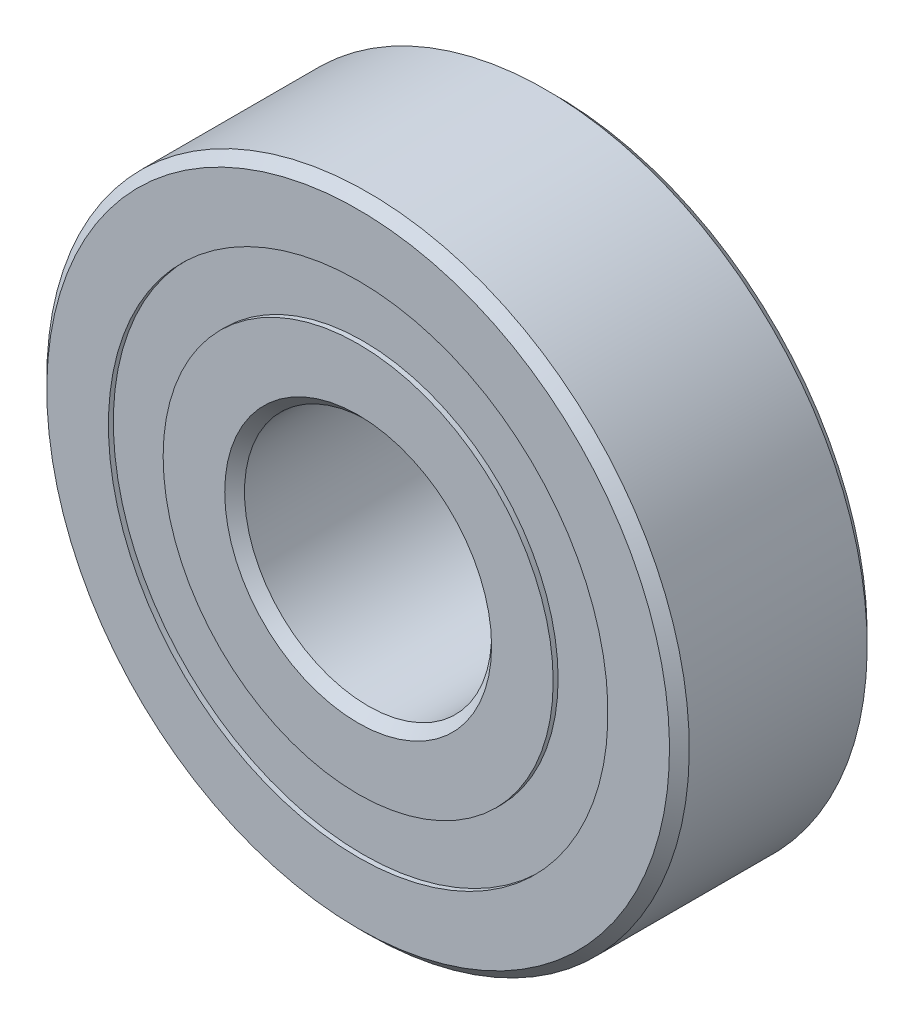
ISO-10303-21;
HEADER;
FILE_DESCRIPTION(('STEP AP214'),'2;1');
FILE_NAME('part.step','',(''),(''),'','','');
FILE_SCHEMA(('AUTOMOTIVE_DESIGN { 1 0 10303 214 1 1 1 1 }'));
ENDSEC;
DATA;
#1=APPLICATION_CONTEXT('core data for automotive mechanical design processes');
#2=APPLICATION_PROTOCOL_DEFINITION('international standard','automotive_design',2000,#1);
#3=PRODUCT_CONTEXT('',#1,'mechanical');
#4=PRODUCT('Part','Part','',(#3));
#5=PRODUCT_RELATED_PRODUCT_CATEGORY('part','',(#4));
#6=PRODUCT_DEFINITION_FORMATION('','',#4);
#7=PRODUCT_DEFINITION_CONTEXT('part definition',#1,'design');
#8=PRODUCT_DEFINITION('design','',#6,#7);
#9=PRODUCT_DEFINITION_SHAPE('','',#8);
#10=(LENGTH_UNIT() NAMED_UNIT(*) SI_UNIT(.MILLI.,.METRE.));
#11=(NAMED_UNIT(*) PLANE_ANGLE_UNIT() SI_UNIT($,.RADIAN.));
#12=(NAMED_UNIT(*) SI_UNIT($,.STERADIAN.) SOLID_ANGLE_UNIT());
#13=UNCERTAINTY_MEASURE_WITH_UNIT(LENGTH_MEASURE(1.E-05),#10,'distance_accuracy_value','');
#14=(GEOMETRIC_REPRESENTATION_CONTEXT(3) GLOBAL_UNCERTAINTY_ASSIGNED_CONTEXT((#13)) GLOBAL_UNIT_ASSIGNED_CONTEXT((#10,
#11,#12)) REPRESENTATION_CONTEXT('',''));
#15=CARTESIAN_POINT('',(0.,0.,0.));
#16=DIRECTION('',(0.,0.,1.));
#17=DIRECTION('',(1.,0.,0.));
#18=AXIS2_PLACEMENT_3D('',#15,#16,#17);
#19=CARTESIAN_POINT('',(0.,10.1076923076923,-3.8));
#20=DIRECTION('',(0.,0.,1.));
#21=DIRECTION('',(0.,-1.,0.));
#22=AXIS2_PLACEMENT_3D('',#19,#20,#21);
#23=PLANE('',#22);
#24=CARTESIAN_POINT('',(0.,0.,-3.8));
#25=DIRECTION('',(0.,0.,1.));
#26=DIRECTION('',(0.,-1.,0.));
#27=AXIS2_PLACEMENT_3D('',#24,#25,#26);
#28=CIRCLE('',#27,10.1076923076923);
#29=CARTESIAN_POINT('',(0.,-10.1076923076923,-3.8));
#30=VERTEX_POINT('',#29);
#31=EDGE_CURVE('E55',#30,#30,#28,.T.);
#32=ORIENTED_EDGE('',*,*,#31,.F.);
#33=EDGE_LOOP('',(#32));
#34=FACE_BOUND('',#33,.T.);
#35=CARTESIAN_POINT('',(0.,0.,-3.8));
#36=DIRECTION('',(0.,0.,1.));
#37=DIRECTION('',(0.,-1.,0.));
#38=AXIS2_PLACEMENT_3D('',#35,#36,#37);
#39=CIRCLE('',#38,7.89230769230768);
#40=CARTESIAN_POINT('',(0.,-7.89230769230768,-3.8));
#41=VERTEX_POINT('',#40);
#42=EDGE_CURVE('E11',#41,#41,#39,.T.);
#43=ORIENTED_EDGE('',*,*,#42,.T.);
#44=EDGE_LOOP('',(#43));
#45=FACE_BOUND('',#44,.T.);
#46=ADVANCED_FACE('F41',(#34,#45),#23,.F.);
#47=CARTESIAN_POINT('',(0.,0.,4.));
#48=DIRECTION('',(0.,0.,1.));
#49=DIRECTION('',(0.,-1.,0.));
#50=AXIS2_PLACEMENT_3D('',#47,#48,#49);
#51=CYLINDRICAL_SURFACE('',#50,7.89230769230768);
#52=ORIENTED_EDGE('',*,*,#42,.F.);
#53=EDGE_LOOP('',(#52));
#54=FACE_BOUND('',#53,.T.);
#55=CARTESIAN_POINT('',(0.,0.,-2.09463029570405));
#56=DIRECTION('',(0.,0.,1.));
#57=DIRECTION('',(0.,-1.,0.));
#58=AXIS2_PLACEMENT_3D('',#55,#56,#57);
#59=CIRCLE('',#58,7.89230769230768);
#60=CARTESIAN_POINT('',(0.,-7.89230769230768,-2.09463029570405));
#61=VERTEX_POINT('',#60);
#62=EDGE_CURVE('E47',#61,#61,#59,.T.);
#63=ORIENTED_EDGE('',*,*,#62,.T.);
#64=EDGE_LOOP('',(#63));
#65=FACE_BOUND('',#64,.T.);
#66=ADVANCED_FACE('F64',(#54,#65),#51,.F.);
#67=CARTESIAN_POINT('',(0.,10.1076923076923,-2.09463029570404));
#68=DIRECTION('',(0.,0.,-1.));
#69=DIRECTION('',(0.,1.,0.));
#70=AXIS2_PLACEMENT_3D('',#67,#68,#69);
#71=PLANE('',#70);
#72=ORIENTED_EDGE('',*,*,#62,.F.);
#73=EDGE_LOOP('',(#72));
#74=FACE_BOUND('',#73,.T.);
#75=CARTESIAN_POINT('',(0.,0.,-2.09463029570404));
#76=DIRECTION('',(0.,0.,1.));
#77=DIRECTION('',(0.,-1.,0.));
#78=AXIS2_PLACEMENT_3D('',#75,#76,#77);
#79=CIRCLE('',#78,10.1076923076923);
#80=CARTESIAN_POINT('',(0.,-10.1076923076923,-2.09463029570405));
#81=VERTEX_POINT('',#80);
#82=EDGE_CURVE('E51',#81,#81,#79,.T.);
#83=ORIENTED_EDGE('',*,*,#82,.T.);
#84=EDGE_LOOP('',(#83));
#85=FACE_BOUND('',#84,.T.);
#86=ADVANCED_FACE('F68',(#74,#85),#71,.F.);
#87=CARTESIAN_POINT('',(0.,0.,4.));
#88=DIRECTION('',(0.,0.,1.));
#89=DIRECTION('',(0.,-1.,0.));
#90=AXIS2_PLACEMENT_3D('',#87,#88,#89);
#91=CYLINDRICAL_SURFACE('',#90,10.1076923076923);
#92=ORIENTED_EDGE('',*,*,#82,.F.);
#93=EDGE_LOOP('',(#92));
#94=FACE_BOUND('',#93,.T.);
#95=ORIENTED_EDGE('',*,*,#31,.T.);
#96=EDGE_LOOP('',(#95));
#97=FACE_BOUND('',#96,.T.);
#98=ADVANCED_FACE('F61',(#94,#97),#91,.T.);
#99=CLOSED_SHELL('',(#46,#66,#86,#98));
#100=MANIFOLD_SOLID_BREP('B2',#99);
#101=CARTESIAN_POINT('',(0.,10.1076923076923,3.8));
#102=DIRECTION('',(0.,0.,-1.));
#103=DIRECTION('',(0.,1.,0.));
#104=AXIS2_PLACEMENT_3D('',#101,#102,#103);
#105=PLANE('',#104);
#106=CARTESIAN_POINT('',(0.,0.,3.8));
#107=DIRECTION('',(0.,0.,1.));
#108=DIRECTION('',(0.,-1.,0.));
#109=AXIS2_PLACEMENT_3D('',#106,#107,#108);
#110=CIRCLE('',#109,7.89230769230768);
#111=CARTESIAN_POINT('',(0.,-7.89230769230768,3.8));
#112=VERTEX_POINT('',#111);
#113=EDGE_CURVE('E40',#112,#112,#110,.T.);
#114=ORIENTED_EDGE('',*,*,#113,.F.);
#115=EDGE_LOOP('',(#114));
#116=FACE_BOUND('',#115,.T.);
#117=CARTESIAN_POINT('',(0.,0.,3.8));
#118=DIRECTION('',(0.,0.,1.));
#119=DIRECTION('',(0.,-1.,0.));
#120=AXIS2_PLACEMENT_3D('',#117,#118,#119);
#121=CIRCLE('',#120,10.1076923076923);
#122=CARTESIAN_POINT('',(0.,-10.1076923076923,3.8));
#123=VERTEX_POINT('',#122);
#124=EDGE_CURVE('E122',#123,#123,#121,.T.);
#125=ORIENTED_EDGE('',*,*,#124,.T.);
#126=EDGE_LOOP('',(#125));
#127=FACE_BOUND('',#126,.T.);
#128=ADVANCED_FACE('F108',(#116,#127),#105,.F.);
#129=CARTESIAN_POINT('',(0.,0.,4.));
#130=DIRECTION('',(0.,0.,1.));
#131=DIRECTION('',(0.,-1.,0.));
#132=AXIS2_PLACEMENT_3D('',#129,#130,#131);
#133=CYLINDRICAL_SURFACE('',#132,7.89230769230768);
#134=CARTESIAN_POINT('',(0.,0.,2.09463029570404));
#135=DIRECTION('',(0.,0.,1.));
#136=DIRECTION('',(0.,-1.,0.));
#137=AXIS2_PLACEMENT_3D('',#134,#135,#136);
#138=CIRCLE('',#137,7.89230769230768);
#139=CARTESIAN_POINT('',(0.,-7.89230769230768,2.09463029570404));
#140=VERTEX_POINT('',#139);
#141=EDGE_CURVE('E114',#140,#140,#138,.T.);
#142=ORIENTED_EDGE('',*,*,#141,.F.);
#143=EDGE_LOOP('',(#142));
#144=FACE_BOUND('',#143,.T.);
#145=ORIENTED_EDGE('',*,*,#113,.T.);
#146=EDGE_LOOP('',(#145));
#147=FACE_BOUND('',#146,.T.);
#148=ADVANCED_FACE('F137',(#144,#147),#133,.F.);
#149=CARTESIAN_POINT('',(0.,10.1076923076923,2.09463029570404));
#150=DIRECTION('',(0.,0.,1.));
#151=DIRECTION('',(0.,-1.,0.));
#152=AXIS2_PLACEMENT_3D('',#149,#150,#151);
#153=PLANE('',#152);
#154=CARTESIAN_POINT('',(0.,0.,2.09463029570404));
#155=DIRECTION('',(0.,0.,1.));
#156=DIRECTION('',(0.,-1.,0.));
#157=AXIS2_PLACEMENT_3D('',#154,#155,#156);
#158=CIRCLE('',#157,10.1076923076923);
#159=CARTESIAN_POINT('',(0.,-10.1076923076923,2.09463029570404));
#160=VERTEX_POINT('',#159);
#161=EDGE_CURVE('E118',#160,#160,#158,.T.);
#162=ORIENTED_EDGE('',*,*,#161,.F.);
#163=EDGE_LOOP('',(#162));
#164=FACE_BOUND('',#163,.T.);
#165=ORIENTED_EDGE('',*,*,#141,.T.);
#166=EDGE_LOOP('',(#165));
#167=FACE_BOUND('',#166,.T.);
#168=ADVANCED_FACE('F132',(#164,#167),#153,.F.);
#169=CARTESIAN_POINT('',(0.,0.,4.));
#170=DIRECTION('',(0.,0.,1.));
#171=DIRECTION('',(0.,-1.,0.));
#172=AXIS2_PLACEMENT_3D('',#169,#170,#171);
#173=CYLINDRICAL_SURFACE('',#172,10.1076923076923);
#174=ORIENTED_EDGE('',*,*,#124,.F.);
#175=EDGE_LOOP('',(#174));
#176=FACE_BOUND('',#175,.T.);
#177=ORIENTED_EDGE('',*,*,#161,.T.);
#178=EDGE_LOOP('',(#177));
#179=FACE_BOUND('',#178,.T.);
#180=ADVANCED_FACE('F129',(#176,#179),#173,.T.);
#181=CLOSED_SHELL('',(#128,#148,#168,#180));
#182=MANIFOLD_SOLID_BREP('B6',#181);
#183=CARTESIAN_POINT('',(-5.29006727063216,7.2811529493746,0.));
#184=DIRECTION('',(0.,0.,1.));
#185=DIRECTION('',(-0.587785252292462,0.809016994374955,0.));
#186=AXIS2_PLACEMENT_3D('',#183,#184,#185);
#187=SPHERICAL_SURFACE('',#186,2.09463029570404);
#188=CARTESIAN_POINT('',(-5.29006727063216,7.2811529493746,2.09463029570404));
#189=VERTEX_POINT('',#188);
#190=VERTEX_LOOP('',#189);
#191=FACE_BOUND('',#190,.T.);
#192=ADVANCED_FACE('F188',(#191),#187,.T.);
#193=CLOSED_SHELL('',(#192));
#194=MANIFOLD_SOLID_BREP('B35',#193);
#195=CARTESIAN_POINT('',(-8.55950864665635,2.78115294937462,0.));
#196=DIRECTION('',(0.,0.,1.));
#197=DIRECTION('',(-0.95105651629515,0.309016994374958,0.));
#198=AXIS2_PLACEMENT_3D('',#195,#196,#197);
#199=SPHERICAL_SURFACE('',#198,2.09463029570404);
#200=CARTESIAN_POINT('',(-8.55950864665635,2.78115294937462,2.09463029570404));
#201=VERTEX_POINT('',#200);
#202=VERTEX_LOOP('',#201);
#203=FACE_BOUND('',#202,.T.);
#204=ADVANCED_FACE('F206',(#203),#199,.T.);
#205=CLOSED_SHELL('',(#204));
#206=MANIFOLD_SOLID_BREP('B104',#205);
#207=CARTESIAN_POINT('',(-8.55950864665641,-2.78115294937444,0.));
#208=DIRECTION('',(0.,0.,1.));
#209=DIRECTION('',(-0.951056516295157,-0.309016994374938,0.));
#210=AXIS2_PLACEMENT_3D('',#207,#208,#209);
#211=SPHERICAL_SURFACE('',#210,2.09463029570404);
#212=CARTESIAN_POINT('',(-8.55950864665641,-2.78115294937445,2.09463029570404));
#213=VERTEX_POINT('',#212);
#214=VERTEX_LOOP('',#213);
#215=FACE_BOUND('',#214,.T.);
#216=ADVANCED_FACE('F224',(#215),#211,.T.);
#217=CLOSED_SHELL('',(#216));
#218=MANIFOLD_SOLID_BREP('B184',#217);
#219=CARTESIAN_POINT('',(-5.29006727063232,-7.28115294937448,0.));
#220=DIRECTION('',(0.,0.,1.));
#221=DIRECTION('',(-0.58778525229248,-0.809016994374942,0.));
#222=AXIS2_PLACEMENT_3D('',#219,#220,#221);
#223=SPHERICAL_SURFACE('',#222,2.09463029570404);
#224=CARTESIAN_POINT('',(-5.29006727063232,-7.28115294937448,2.09463029570404));
#225=VERTEX_POINT('',#224);
#226=VERTEX_LOOP('',#225);
#227=FACE_BOUND('',#226,.T.);
#228=ADVANCED_FACE('F242',(#227),#223,.T.);
#229=CLOSED_SHELL('',(#228));
#230=MANIFOLD_SOLID_BREP('B202',#229);
#231=CARTESIAN_POINT('',(0.,-9.,0.));
#232=DIRECTION('',(0.,0.,1.));
#233=DIRECTION('',(0.,-1.,0.));
#234=AXIS2_PLACEMENT_3D('',#231,#232,#233);
#235=SPHERICAL_SURFACE('',#234,2.09463029570404);
#236=CARTESIAN_POINT('',(0.,-9.,2.09463029570404));
#237=VERTEX_POINT('',#236);
#238=VERTEX_LOOP('',#237);
#239=FACE_BOUND('',#238,.T.);
#240=ADVANCED_FACE('F260',(#239),#235,.T.);
#241=CLOSED_SHELL('',(#240));
#242=MANIFOLD_SOLID_BREP('B220',#241);
#243=CARTESIAN_POINT('',(5.29006727063222,-7.28115294937456,0.));
#244=DIRECTION('',(0.,0.,1.));
#245=DIRECTION('',(0.587785252292469,-0.809016994374951,0.));
#246=AXIS2_PLACEMENT_3D('',#243,#244,#245);
#247=SPHERICAL_SURFACE('',#246,2.09463029570404);
#248=CARTESIAN_POINT('',(5.29006727063222,-7.28115294937456,2.09463029570404));
#249=VERTEX_POINT('',#248);
#250=VERTEX_LOOP('',#249);
#251=FACE_BOUND('',#250,.T.);
#252=ADVANCED_FACE('F278',(#251),#247,.T.);
#253=CLOSED_SHELL('',(#252));
#254=MANIFOLD_SOLID_BREP('B238',#253);
#255=CARTESIAN_POINT('',(8.55950864665637,-2.78115294937456,0.));
#256=DIRECTION('',(0.,0.,1.));
#257=DIRECTION('',(0.951056516295152,-0.309016994374952,0.));
#258=AXIS2_PLACEMENT_3D('',#255,#256,#257);
#259=SPHERICAL_SURFACE('',#258,2.09463029570404);
#260=CARTESIAN_POINT('',(8.55950864665637,-2.78115294937457,2.09463029570404));
#261=VERTEX_POINT('',#260);
#262=VERTEX_LOOP('',#261);
#263=FACE_BOUND('',#262,.T.);
#264=ADVANCED_FACE('F296',(#263),#259,.T.);
#265=CLOSED_SHELL('',(#264));
#266=MANIFOLD_SOLID_BREP('B256',#265);
#267=CARTESIAN_POINT('',(8.55950864665639,2.7811529493745,0.));
#268=DIRECTION('',(0.,0.,1.));
#269=DIRECTION('',(0.951056516295155,0.309016994374945,0.));
#270=AXIS2_PLACEMENT_3D('',#267,#268,#269);
#271=SPHERICAL_SURFACE('',#270,2.09463029570404);
#272=CARTESIAN_POINT('',(8.55950864665639,2.7811529493745,2.09463029570404));
#273=VERTEX_POINT('',#272);
#274=VERTEX_LOOP('',#273);
#275=FACE_BOUND('',#274,.T.);
#276=ADVANCED_FACE('F314',(#275),#271,.T.);
#277=CLOSED_SHELL('',(#276));
#278=MANIFOLD_SOLID_BREP('B274',#277);
#279=CARTESIAN_POINT('',(5.29006727063227,7.28115294937452,0.));
#280=DIRECTION('',(0.,0.,1.));
#281=DIRECTION('',(0.587785252292474,0.809016994374947,0.));
#282=AXIS2_PLACEMENT_3D('',#279,#280,#281);
#283=SPHERICAL_SURFACE('',#282,2.09463029570404);
#284=CARTESIAN_POINT('',(5.29006727063227,7.28115294937452,2.09463029570404));
#285=VERTEX_POINT('',#284);
#286=VERTEX_LOOP('',#285);
#287=FACE_BOUND('',#286,.T.);
#288=ADVANCED_FACE('F332',(#287),#283,.T.);
#289=CLOSED_SHELL('',(#288));
#290=MANIFOLD_SOLID_BREP('B292',#289);
#291=CARTESIAN_POINT('',(0.,9.,0.));
#292=DIRECTION('',(0.,0.,1.));
#293=DIRECTION('',(0.,1.,0.));
#294=AXIS2_PLACEMENT_3D('',#291,#292,#293);
#295=SPHERICAL_SURFACE('',#294,2.09463029570404);
#296=CARTESIAN_POINT('',(0.,9.,2.09463029570404));
#297=VERTEX_POINT('',#296);
#298=VERTEX_LOOP('',#297);
#299=FACE_BOUND('',#298,.T.);
#300=ADVANCED_FACE('F352',(#299),#295,.T.);
#301=CLOSED_SHELL('',(#300));
#302=MANIFOLD_SOLID_BREP('B310',#301);
#303=CARTESIAN_POINT('',(0.,5.39999999999999,4.00000000000001));
#304=DIRECTION('',(0.,0.,-1.));
#305=DIRECTION('',(0.,1.,0.));
#306=AXIS2_PLACEMENT_3D('',#303,#304,#305);
#307=PLANE('',#306);
#308=CARTESIAN_POINT('',(0.,0.,4.));
#309=DIRECTION('',(0.,0.,1.));
#310=DIRECTION('',(0.,-1.,0.));
#311=AXIS2_PLACEMENT_3D('',#308,#309,#310);
#312=CIRCLE('',#311,5.39999999999999);
#313=CARTESIAN_POINT('',(0.,-5.39999999999999,4.));
#314=VERTEX_POINT('',#313);
#315=EDGE_CURVE('E399',#314,#314,#312,.T.);
#316=ORIENTED_EDGE('',*,*,#315,.F.);
#317=EDGE_LOOP('',(#316));
#318=FACE_BOUND('',#317,.T.);
#319=CARTESIAN_POINT('',(0.,0.,4.));
#320=DIRECTION('',(0.,0.,1.));
#321=DIRECTION('',(0.,-1.,0.));
#322=AXIS2_PLACEMENT_3D('',#319,#320,#321);
#323=CIRCLE('',#322,7.89230769230768);
#324=CARTESIAN_POINT('',(0.,-7.89230769230768,4.));
#325=VERTEX_POINT('',#324);
#326=EDGE_CURVE('E351',#325,#325,#323,.T.);
#327=ORIENTED_EDGE('',*,*,#326,.T.);
#328=EDGE_LOOP('',(#327));
#329=FACE_BOUND('',#328,.T.);
#330=ADVANCED_FACE('F371',(#318,#329),#307,.F.);
#331=CARTESIAN_POINT('',(0.,0.,4.));
#332=DIRECTION('',(0.,0.,1.));
#333=DIRECTION('',(0.,-1.,0.));
#334=AXIS2_PLACEMENT_3D('',#331,#332,#333);
#335=CYLINDRICAL_SURFACE('',#334,7.89230769230768);
#336=ORIENTED_EDGE('',*,*,#326,.F.);
#337=EDGE_LOOP('',(#336));
#338=FACE_BOUND('',#337,.T.);
#339=CARTESIAN_POINT('',(0.,0.,1.77777777777777));
#340=DIRECTION('',(0.,0.,1.));
#341=DIRECTION('',(0.,-1.,0.));
#342=AXIS2_PLACEMENT_3D('',#339,#340,#341);
#343=CIRCLE('',#342,7.89230769230769);
#344=CARTESIAN_POINT('',(0.,-7.89230769230769,1.77777777777777));
#345=VERTEX_POINT('',#344);
#346=EDGE_CURVE('E377',#345,#345,#343,.T.);
#347=ORIENTED_EDGE('',*,*,#346,.T.);
#348=EDGE_LOOP('',(#347));
#349=FACE_BOUND('',#348,.T.);
#350=ADVANCED_FACE('F406',(#338,#349),#335,.T.);
#351=CARTESIAN_POINT('',(0.,0.,0.));
#352=DIRECTION('',(0.,0.,1.));
#353=DIRECTION('',(0.,-1.,0.));
#354=AXIS2_PLACEMENT_3D('',#351,#352,#353);
#355=TOROIDAL_SURFACE('',#354,9.,2.09463029570404);
#356=ORIENTED_EDGE('',*,*,#346,.F.);
#357=EDGE_LOOP('',(#356));
#358=FACE_BOUND('',#357,.T.);
#359=CARTESIAN_POINT('',(0.,0.,-1.77777777777778));
#360=DIRECTION('',(0.,0.,1.));
#361=DIRECTION('',(0.,-1.,0.));
#362=AXIS2_PLACEMENT_3D('',#359,#360,#361);
#363=CIRCLE('',#362,7.89230769230768);
#364=CARTESIAN_POINT('',(0.,-7.89230769230768,-1.77777777777778));
#365=VERTEX_POINT('',#364);
#366=EDGE_CURVE('E381',#365,#365,#363,.T.);
#367=ORIENTED_EDGE('',*,*,#366,.T.);
#368=EDGE_LOOP('',(#367));
#369=FACE_BOUND('',#368,.T.);
#370=ADVANCED_FACE('F410',(#358,#369),#355,.F.);
#371=CARTESIAN_POINT('',(0.,0.,4.));
#372=DIRECTION('',(0.,0.,1.));
#373=DIRECTION('',(0.,-1.,0.));
#374=AXIS2_PLACEMENT_3D('',#371,#372,#373);
#375=CYLINDRICAL_SURFACE('',#374,7.89230769230768);
#376=ORIENTED_EDGE('',*,*,#366,.F.);
#377=EDGE_LOOP('',(#376));
#378=FACE_BOUND('',#377,.T.);
#379=CARTESIAN_POINT('',(0.,0.,-4.00000000000001));
#380=DIRECTION('',(0.,0.,1.));
#381=DIRECTION('',(0.,-1.,0.));
#382=AXIS2_PLACEMENT_3D('',#379,#380,#381);
#383=CIRCLE('',#382,7.89230769230768);
#384=CARTESIAN_POINT('',(0.,-7.89230769230768,-4.00000000000001));
#385=VERTEX_POINT('',#384);
#386=EDGE_CURVE('E385',#385,#385,#383,.T.);
#387=ORIENTED_EDGE('',*,*,#386,.T.);
#388=EDGE_LOOP('',(#387));
#389=FACE_BOUND('',#388,.T.);
#390=ADVANCED_FACE('F415',(#378,#389),#375,.T.);
#391=CARTESIAN_POINT('',(0.,5.39999999999999,-4.00000000000001));
#392=DIRECTION('',(0.,0.,1.));
#393=DIRECTION('',(0.,-1.,0.));
#394=AXIS2_PLACEMENT_3D('',#391,#392,#393);
#395=PLANE('',#394);
#396=ORIENTED_EDGE('',*,*,#386,.F.);
#397=EDGE_LOOP('',(#396));
#398=FACE_BOUND('',#397,.T.);
#399=CARTESIAN_POINT('',(0.,0.,-4.00000000000001));
#400=DIRECTION('',(0.,0.,1.));
#401=DIRECTION('',(0.,-1.,0.));
#402=AXIS2_PLACEMENT_3D('',#399,#400,#401);
#403=CIRCLE('',#402,5.39999999999999);
#404=CARTESIAN_POINT('',(0.,-5.39999999999999,-4.00000000000001));
#405=VERTEX_POINT('',#404);
#406=EDGE_CURVE('E390',#405,#405,#403,.T.);
#407=ORIENTED_EDGE('',*,*,#406,.T.);
#408=EDGE_LOOP('',(#407));
#409=FACE_BOUND('',#408,.T.);
#410=ADVANCED_FACE('F421',(#398,#409),#395,.F.);
#411=CARTESIAN_POINT('',(0.,0.,-3.6));
#412=DIRECTION('',(0.,0.,-1.));
#413=DIRECTION('',(0.,1.,0.));
#414=AXIS2_PLACEMENT_3D('',#411,#412,#413);
#415=CONICAL_SURFACE('',#414,5.,0.78539816339743);
#416=ORIENTED_EDGE('',*,*,#406,.F.);
#417=EDGE_LOOP('',(#416));
#418=FACE_BOUND('',#417,.T.);
#419=CARTESIAN_POINT('',(0.,0.,-3.6));
#420=DIRECTION('',(0.,0.,1.));
#421=DIRECTION('',(0.,-1.,0.));
#422=AXIS2_PLACEMENT_3D('',#419,#420,#421);
#423=CIRCLE('',#422,5.);
#424=CARTESIAN_POINT('',(0.,-5.,-3.6));
#425=VERTEX_POINT('',#424);
#426=EDGE_CURVE('E393',#425,#425,#423,.T.);
#427=ORIENTED_EDGE('',*,*,#426,.T.);
#428=EDGE_LOOP('',(#427));
#429=FACE_BOUND('',#428,.T.);
#430=ADVANCED_FACE('F425',(#418,#429),#415,.F.);
#431=CARTESIAN_POINT('',(0.,0.,4.));
#432=DIRECTION('',(0.,0.,1.));
#433=DIRECTION('',(0.,-1.,0.));
#434=AXIS2_PLACEMENT_3D('',#431,#432,#433);
#435=CYLINDRICAL_SURFACE('',#434,5.);
#436=ORIENTED_EDGE('',*,*,#426,.F.);
#437=EDGE_LOOP('',(#436));
#438=FACE_BOUND('',#437,.T.);
#439=CARTESIAN_POINT('',(0.,0.,3.6));
#440=DIRECTION('',(0.,0.,1.));
#441=DIRECTION('',(0.,-1.,0.));
#442=AXIS2_PLACEMENT_3D('',#439,#440,#441);
#443=CIRCLE('',#442,5.);
#444=CARTESIAN_POINT('',(0.,-5.,3.6));
#445=VERTEX_POINT('',#444);
#446=EDGE_CURVE('E396',#445,#445,#443,.T.);
#447=ORIENTED_EDGE('',*,*,#446,.T.);
#448=EDGE_LOOP('',(#447));
#449=FACE_BOUND('',#448,.T.);
#450=ADVANCED_FACE('F429',(#438,#449),#435,.F.);
#451=CARTESIAN_POINT('',(0.,0.,4.));
#452=DIRECTION('',(0.,0.,1.));
#453=DIRECTION('',(0.,-1.,0.));
#454=AXIS2_PLACEMENT_3D('',#451,#452,#453);
#455=CONICAL_SURFACE('',#454,5.39999999999999,0.785398163397431);
#456=ORIENTED_EDGE('',*,*,#446,.F.);
#457=EDGE_LOOP('',(#456));
#458=FACE_BOUND('',#457,.T.);
#459=ORIENTED_EDGE('',*,*,#315,.T.);
#460=EDGE_LOOP('',(#459));
#461=FACE_BOUND('',#460,.T.);
#462=ADVANCED_FACE('F403',(#458,#461),#455,.F.);
#463=CLOSED_SHELL('',(#330,#350,#370,#390,#410,#430,#450,#462));
#464=MANIFOLD_SOLID_BREP('B328',#463);
#465=CARTESIAN_POINT('',(0.,0.,4.));
#466=DIRECTION('',(0.,0.,1.));
#467=DIRECTION('',(0.,-1.,0.));
#468=AXIS2_PLACEMENT_3D('',#465,#466,#467);
#469=CYLINDRICAL_SURFACE('',#468,13.);
#470=CARTESIAN_POINT('',(0.,0.,3.6));
#471=DIRECTION('',(0.,0.,1.));
#472=DIRECTION('',(0.,-1.,0.));
#473=AXIS2_PLACEMENT_3D('',#470,#471,#472);
#474=CIRCLE('',#473,13.);
#475=CARTESIAN_POINT('',(0.,-13.,3.6));
#476=VERTEX_POINT('',#475);
#477=EDGE_CURVE('E370',#476,#476,#474,.T.);
#478=ORIENTED_EDGE('',*,*,#477,.F.);
#479=EDGE_LOOP('',(#478));
#480=FACE_BOUND('',#479,.T.);
#481=CARTESIAN_POINT('',(0.,0.,-3.6));
#482=DIRECTION('',(0.,0.,1.));
#483=DIRECTION('',(0.,-1.,0.));
#484=AXIS2_PLACEMENT_3D('',#481,#482,#483);
#485=CIRCLE('',#484,13.);
#486=CARTESIAN_POINT('',(0.,-13.,-3.6));
#487=VERTEX_POINT('',#486);
#488=EDGE_CURVE('E520',#487,#487,#485,.T.);
#489=ORIENTED_EDGE('',*,*,#488,.T.);
#490=EDGE_LOOP('',(#489));
#491=FACE_BOUND('',#490,.T.);
#492=ADVANCED_FACE('F492',(#480,#491),#469,.T.);
#493=CARTESIAN_POINT('',(0.,0.,3.6));
#494=DIRECTION('',(0.,0.,-1.));
#495=DIRECTION('',(0.,1.,0.));
#496=AXIS2_PLACEMENT_3D('',#493,#494,#495);
#497=CONICAL_SURFACE('',#496,13.,0.785398163397445);
#498=CARTESIAN_POINT('',(0.,0.,4.));
#499=DIRECTION('',(0.,0.,1.));
#500=DIRECTION('',(0.,-1.,0.));
#501=AXIS2_PLACEMENT_3D('',#498,#499,#500);
#502=CIRCLE('',#501,12.6);
#503=CARTESIAN_POINT('',(0.,-12.6,4.));
#504=VERTEX_POINT('',#503);
#505=EDGE_CURVE('E498',#504,#504,#502,.T.);
#506=ORIENTED_EDGE('',*,*,#505,.F.);
#507=EDGE_LOOP('',(#506));
#508=FACE_BOUND('',#507,.T.);
#509=ORIENTED_EDGE('',*,*,#477,.T.);
#510=EDGE_LOOP('',(#509));
#511=FACE_BOUND('',#510,.T.);
#512=ADVANCED_FACE('F557',(#508,#511),#497,.T.);
#513=CARTESIAN_POINT('',(0.,12.6,4.));
#514=DIRECTION('',(0.,0.,-1.));
#515=DIRECTION('',(0.,1.,0.));
#516=AXIS2_PLACEMENT_3D('',#513,#514,#515);
#517=PLANE('',#516);
#518=CARTESIAN_POINT('',(0.,0.,4.));
#519=DIRECTION('',(0.,0.,1.));
#520=DIRECTION('',(0.,-1.,0.));
#521=AXIS2_PLACEMENT_3D('',#518,#519,#520);
#522=CIRCLE('',#521,10.1076923076923);
#523=CARTESIAN_POINT('',(0.,-10.1076923076923,4.));
#524=VERTEX_POINT('',#523);
#525=EDGE_CURVE('E502',#524,#524,#522,.T.);
#526=ORIENTED_EDGE('',*,*,#525,.F.);
#527=EDGE_LOOP('',(#526));
#528=FACE_BOUND('',#527,.T.);
#529=ORIENTED_EDGE('',*,*,#505,.T.);
#530=EDGE_LOOP('',(#529));
#531=FACE_BOUND('',#530,.T.);
#532=ADVANCED_FACE('F552',(#528,#531),#517,.F.);
#533=CARTESIAN_POINT('',(0.,0.,4.));
#534=DIRECTION('',(0.,0.,1.));
#535=DIRECTION('',(0.,-1.,0.));
#536=AXIS2_PLACEMENT_3D('',#533,#534,#535);
#537=CYLINDRICAL_SURFACE('',#536,10.1076923076923);
#538=CARTESIAN_POINT('',(0.,0.,1.77777777777778));
#539=DIRECTION('',(0.,0.,1.));
#540=DIRECTION('',(0.,-1.,0.));
#541=AXIS2_PLACEMENT_3D('',#538,#539,#540);
#542=CIRCLE('',#541,10.1076923076923);
#543=CARTESIAN_POINT('',(0.,-10.1076923076923,1.77777777777778));
#544=VERTEX_POINT('',#543);
#545=EDGE_CURVE('E506',#544,#544,#542,.T.);
#546=ORIENTED_EDGE('',*,*,#545,.F.);
#547=EDGE_LOOP('',(#546));
#548=FACE_BOUND('',#547,.T.);
#549=ORIENTED_EDGE('',*,*,#525,.T.);
#550=EDGE_LOOP('',(#549));
#551=FACE_BOUND('',#550,.T.);
#552=ADVANCED_FACE('F546',(#548,#551),#537,.F.);
#553=CARTESIAN_POINT('',(0.,0.,0.));
#554=DIRECTION('',(0.,0.,1.));
#555=DIRECTION('',(0.,-1.,0.));
#556=AXIS2_PLACEMENT_3D('',#553,#554,#555);
#557=TOROIDAL_SURFACE('',#556,9.,2.09463029570404);
#558=CARTESIAN_POINT('',(0.,0.,-1.77777777777778));
#559=DIRECTION('',(0.,0.,1.));
#560=DIRECTION('',(0.,-1.,0.));
#561=AXIS2_PLACEMENT_3D('',#558,#559,#560);
#562=CIRCLE('',#561,10.1076923076923);
#563=CARTESIAN_POINT('',(0.,-10.1076923076923,-1.77777777777778));
#564=VERTEX_POINT('',#563);
#565=EDGE_CURVE('E511',#564,#564,#562,.T.);
#566=ORIENTED_EDGE('',*,*,#565,.F.);
#567=EDGE_LOOP('',(#566));
#568=FACE_BOUND('',#567,.T.);
#569=ORIENTED_EDGE('',*,*,#545,.T.);
#570=EDGE_LOOP('',(#569));
#571=FACE_BOUND('',#570,.T.);
#572=ADVANCED_FACE('F540',(#568,#571),#557,.F.);
#573=CARTESIAN_POINT('',(0.,0.,4.));
#574=DIRECTION('',(0.,0.,1.));
#575=DIRECTION('',(0.,-1.,0.));
#576=AXIS2_PLACEMENT_3D('',#573,#574,#575);
#577=CYLINDRICAL_SURFACE('',#576,10.1076923076923);
#578=CARTESIAN_POINT('',(0.,0.,-4.));
#579=DIRECTION('',(0.,0.,1.));
#580=DIRECTION('',(0.,-1.,0.));
#581=AXIS2_PLACEMENT_3D('',#578,#579,#580);
#582=CIRCLE('',#581,10.1076923076923);
#583=CARTESIAN_POINT('',(0.,-10.1076923076923,-4.));
#584=VERTEX_POINT('',#583);
#585=EDGE_CURVE('E514',#584,#584,#582,.T.);
#586=ORIENTED_EDGE('',*,*,#585,.F.);
#587=EDGE_LOOP('',(#586));
#588=FACE_BOUND('',#587,.T.);
#589=ORIENTED_EDGE('',*,*,#565,.T.);
#590=EDGE_LOOP('',(#589));
#591=FACE_BOUND('',#590,.T.);
#592=ADVANCED_FACE('F534',(#588,#591),#577,.F.);
#593=CARTESIAN_POINT('',(0.,12.6,-4.));
#594=DIRECTION('',(0.,0.,1.));
#595=DIRECTION('',(0.,-1.,0.));
#596=AXIS2_PLACEMENT_3D('',#593,#594,#595);
#597=PLANE('',#596);
#598=CARTESIAN_POINT('',(0.,0.,-4.));
#599=DIRECTION('',(0.,0.,1.));
#600=DIRECTION('',(0.,-1.,0.));
#601=AXIS2_PLACEMENT_3D('',#598,#599,#600);
#602=CIRCLE('',#601,12.6);
#603=CARTESIAN_POINT('',(0.,-12.6,-4.));
#604=VERTEX_POINT('',#603);
#605=EDGE_CURVE('E517',#604,#604,#602,.T.);
#606=ORIENTED_EDGE('',*,*,#605,.F.);
#607=EDGE_LOOP('',(#606));
#608=FACE_BOUND('',#607,.T.);
#609=ORIENTED_EDGE('',*,*,#585,.T.);
#610=EDGE_LOOP('',(#609));
#611=FACE_BOUND('',#610,.T.);
#612=ADVANCED_FACE('F528',(#608,#611),#597,.F.);
#613=CARTESIAN_POINT('',(0.,0.,-4.));
#614=DIRECTION('',(0.,0.,1.));
#615=DIRECTION('',(0.,-1.,0.));
#616=AXIS2_PLACEMENT_3D('',#613,#614,#615);
#617=CONICAL_SURFACE('',#616,12.6,0.785398163397446);
#618=ORIENTED_EDGE('',*,*,#488,.F.);
#619=EDGE_LOOP('',(#618));
#620=FACE_BOUND('',#619,.T.);
#621=ORIENTED_EDGE('',*,*,#605,.T.);
#622=EDGE_LOOP('',(#621));
#623=FACE_BOUND('',#622,.T.);
#624=ADVANCED_FACE('F525',(#620,#623),#617,.T.);
#625=CLOSED_SHELL('',(#492,#512,#532,#552,#572,#592,#612,#624));
#626=MANIFOLD_SOLID_BREP('B346',#625);
#627=ADVANCED_BREP_SHAPE_REPRESENTATION('',(#18,#100,#182,#194,#206,#218,#230,#242,#254,#266,
#278,#290,#302,#464,#626),#14);
#628=SHAPE_DEFINITION_REPRESENTATION(#9,#627);
ENDSEC;
END-ISO-10303-21;
